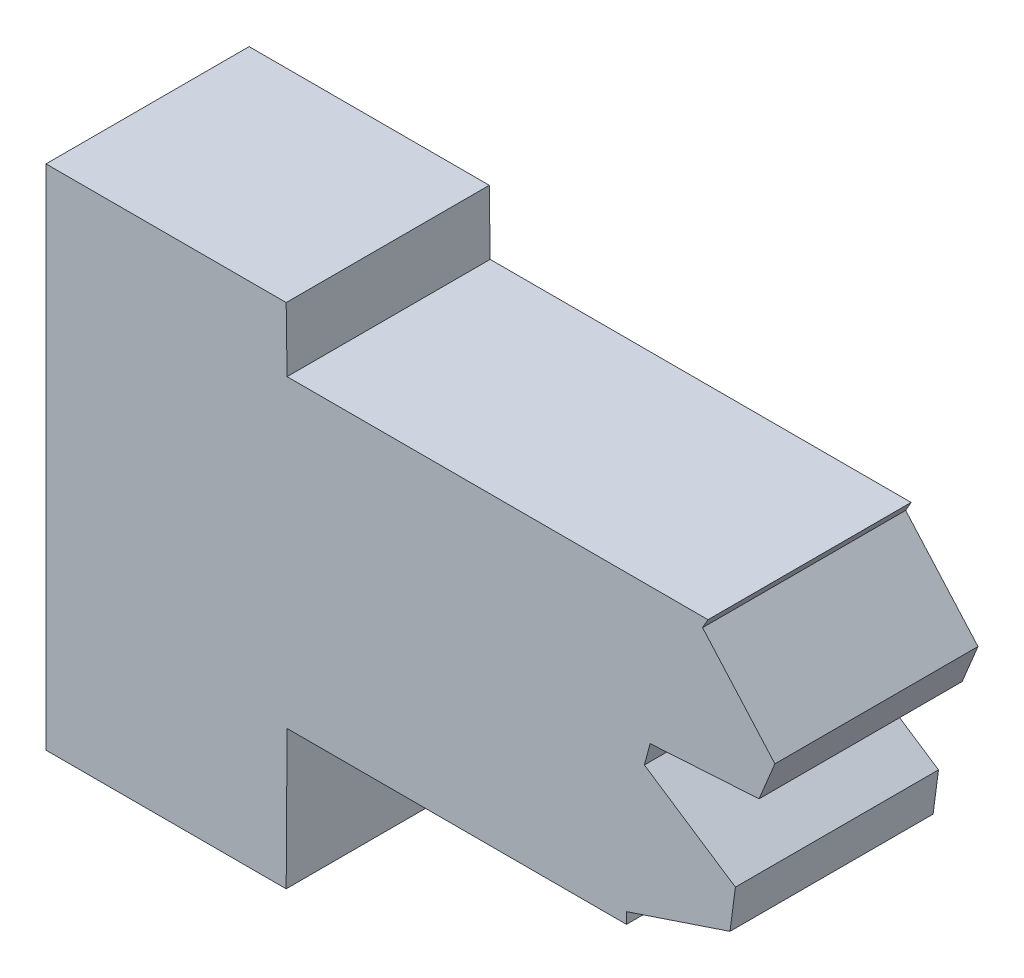
ISO-10303-21;
HEADER;
FILE_DESCRIPTION(('STEP AP214'),'2;1');
FILE_NAME('part.step','',(''),(''),'','','');
FILE_SCHEMA(('AUTOMOTIVE_DESIGN { 1 0 10303 214 1 1 1 1 }'));
ENDSEC;
DATA;
#1=APPLICATION_CONTEXT('core data for automotive mechanical design processes');
#2=APPLICATION_PROTOCOL_DEFINITION('international standard','automotive_design',2000,#1);
#3=PRODUCT_CONTEXT('',#1,'mechanical');
#4=PRODUCT('Part','Part','',(#3));
#5=PRODUCT_RELATED_PRODUCT_CATEGORY('part','',(#4));
#6=PRODUCT_DEFINITION_FORMATION('','',#4);
#7=PRODUCT_DEFINITION_CONTEXT('part definition',#1,'design');
#8=PRODUCT_DEFINITION('design','',#6,#7);
#9=PRODUCT_DEFINITION_SHAPE('','',#8);
#10=(LENGTH_UNIT() NAMED_UNIT(*) SI_UNIT(.MILLI.,.METRE.));
#11=(NAMED_UNIT(*) PLANE_ANGLE_UNIT() SI_UNIT($,.RADIAN.));
#12=(NAMED_UNIT(*) SI_UNIT($,.STERADIAN.) SOLID_ANGLE_UNIT());
#13=UNCERTAINTY_MEASURE_WITH_UNIT(LENGTH_MEASURE(1.E-05),#10,'distance_accuracy_value','');
#14=(GEOMETRIC_REPRESENTATION_CONTEXT(3) GLOBAL_UNCERTAINTY_ASSIGNED_CONTEXT((#13)) GLOBAL_UNIT_ASSIGNED_CONTEXT((#10,
#11,#12)) REPRESENTATION_CONTEXT('',''));
#15=CARTESIAN_POINT('',(0.,0.,0.));
#16=DIRECTION('',(0.,0.,1.));
#17=DIRECTION('',(1.,0.,0.));
#18=AXIS2_PLACEMENT_3D('',#15,#16,#17);
#19=CARTESIAN_POINT('',(12.9304605352733,8.55490384085248,4.));
#20=DIRECTION('',(-0.870533332407199,0.492109456491152,0.));
#21=DIRECTION('',(-0.492109456491152,-0.870533332407199,0.));
#22=AXIS2_PLACEMENT_3D('',#19,#20,#21);
#23=PLANE('',#22);
#24=DIRECTION('',(0.492109456491152,0.870533332407199,0.));
#25=VECTOR('',#24,1.);
#26=CARTESIAN_POINT('',(12.9304605352733,8.55490384085248,0.));
#27=LINE('',#26,#25);
#28=CARTESIAN_POINT('',(12.9304605352733,8.55490384085248,0.));
#29=VERTEX_POINT('',#28);
#30=CARTESIAN_POINT('',(13.0377837049311,8.74475671869166,0.));
#31=VERTEX_POINT('',#30);
#32=EDGE_CURVE('E176',#29,#31,#27,.T.);
#33=ORIENTED_EDGE('',*,*,#32,.T.);
#34=DIRECTION('',(0.,0.,-1.));
#35=VECTOR('',#34,1.);
#36=CARTESIAN_POINT('',(13.0377837049311,8.74475671869166,4.));
#37=LINE('',#36,#35);
#38=CARTESIAN_POINT('',(13.0377837049311,8.74475671869166,4.));
#39=VERTEX_POINT('',#38);
#40=EDGE_CURVE('E11',#39,#31,#37,.T.);
#41=ORIENTED_EDGE('',*,*,#40,.F.);
#42=DIRECTION('',(0.492109456491152,0.870533332407199,0.));
#43=VECTOR('',#42,1.);
#44=CARTESIAN_POINT('',(12.9304605352733,8.55490384085248,4.));
#45=LINE('',#44,#43);
#46=CARTESIAN_POINT('',(12.9304605352733,8.55490384085248,4.));
#47=VERTEX_POINT('',#46);
#48=EDGE_CURVE('E206',#47,#39,#45,.T.);
#49=ORIENTED_EDGE('',*,*,#48,.F.);
#50=DIRECTION('',(0.,0.,-1.));
#51=VECTOR('',#50,1.);
#52=CARTESIAN_POINT('',(12.9304605352733,8.55490384085248,4.));
#53=LINE('',#52,#51);
#54=EDGE_CURVE('E172',#47,#29,#53,.T.);
#55=ORIENTED_EDGE('',*,*,#54,.T.);
#56=EDGE_LOOP('',(#33,#41,#49,#55));
#57=FACE_BOUND('',#56,.T.);
#58=ADVANCED_FACE('F32',(#57),#23,.F.);
#59=CARTESIAN_POINT('',(4.74778370493112,8.74475671869166,4.));
#60=DIRECTION('',(0.,-1.,0.));
#61=DIRECTION('',(0.,0.,-1.));
#62=AXIS2_PLACEMENT_3D('',#59,#60,#61);
#63=PLANE('',#62);
#64=DIRECTION('',(-1.,0.,0.));
#65=VECTOR('',#64,1.);
#66=CARTESIAN_POINT('',(4.74778370493112,8.74475671869166,0.));
#67=LINE('',#66,#65);
#68=CARTESIAN_POINT('',(4.74778370493112,8.74475671869166,0.));
#69=VERTEX_POINT('',#68);
#70=EDGE_CURVE('E179',#31,#69,#67,.T.);
#71=ORIENTED_EDGE('',*,*,#70,.T.);
#72=DIRECTION('',(0.,0.,-1.));
#73=VECTOR('',#72,1.);
#74=CARTESIAN_POINT('',(4.74778370493112,8.74475671869166,4.));
#75=LINE('',#74,#73);
#76=CARTESIAN_POINT('',(4.74778370493112,8.74475671869166,4.));
#77=VERTEX_POINT('',#76);
#78=EDGE_CURVE('E40',#77,#69,#75,.T.);
#79=ORIENTED_EDGE('',*,*,#78,.F.);
#80=DIRECTION('',(-1.,0.,0.));
#81=VECTOR('',#80,1.);
#82=CARTESIAN_POINT('',(4.74778370493112,8.74475671869166,4.));
#83=LINE('',#82,#81);
#84=EDGE_CURVE('E115',#39,#77,#83,.T.);
#85=ORIENTED_EDGE('',*,*,#84,.F.);
#86=ORIENTED_EDGE('',*,*,#40,.T.);
#87=EDGE_LOOP('',(#71,#79,#85,#86));
#88=FACE_BOUND('',#87,.T.);
#89=ADVANCED_FACE('F304',(#88),#63,.F.);
#90=CARTESIAN_POINT('',(4.73,10.,4.));
#91=DIRECTION('',(-0.999899655561117,-0.01416611480819,0.));
#92=DIRECTION('',(0.01416611480819,-0.999899655561117,0.));
#93=AXIS2_PLACEMENT_3D('',#90,#91,#92);
#94=PLANE('',#93);
#95=DIRECTION('',(-0.01416611480819,0.999899655561117,0.));
#96=VECTOR('',#95,1.);
#97=CARTESIAN_POINT('',(4.73,10.,0.));
#98=LINE('',#97,#96);
#99=CARTESIAN_POINT('',(4.73,10.,0.));
#100=VERTEX_POINT('',#99);
#101=EDGE_CURVE('E181',#69,#100,#98,.T.);
#102=ORIENTED_EDGE('',*,*,#101,.T.);
#103=DIRECTION('',(0.,0.,-1.));
#104=VECTOR('',#103,1.);
#105=CARTESIAN_POINT('',(4.73,10.,4.));
#106=LINE('',#105,#104);
#107=CARTESIAN_POINT('',(4.73,10.,4.));
#108=VERTEX_POINT('',#107);
#109=EDGE_CURVE('E237',#108,#100,#106,.T.);
#110=ORIENTED_EDGE('',*,*,#109,.F.);
#111=DIRECTION('',(-0.01416611480819,0.999899655561117,0.));
#112=VECTOR('',#111,1.);
#113=CARTESIAN_POINT('',(4.73,10.,4.));
#114=LINE('',#113,#112);
#115=EDGE_CURVE('E245',#77,#108,#114,.T.);
#116=ORIENTED_EDGE('',*,*,#115,.F.);
#117=ORIENTED_EDGE('',*,*,#78,.T.);
#118=EDGE_LOOP('',(#102,#110,#116,#117));
#119=FACE_BOUND('',#118,.T.);
#120=ADVANCED_FACE('F243',(#119),#94,.F.);
#121=CARTESIAN_POINT('',(4.73,10.,4.));
#122=DIRECTION('',(0.,-1.,0.));
#123=DIRECTION('',(0.,0.,-1.));
#124=AXIS2_PLACEMENT_3D('',#121,#122,#123);
#125=PLANE('',#124);
#126=DIRECTION('',(-1.,0.,0.));
#127=VECTOR('',#126,1.);
#128=CARTESIAN_POINT('',(4.73,10.,0.));
#129=LINE('',#128,#127);
#130=CARTESIAN_POINT('',(0.,10.,0.));
#131=VERTEX_POINT('',#130);
#132=EDGE_CURVE('E183',#100,#131,#129,.T.);
#133=ORIENTED_EDGE('',*,*,#132,.T.);
#134=DIRECTION('',(0.,0.,-1.));
#135=VECTOR('',#134,1.);
#136=CARTESIAN_POINT('',(0.,10.,4.));
#137=LINE('',#136,#135);
#138=CARTESIAN_POINT('',(0.,10.,4.));
#139=VERTEX_POINT('',#138);
#140=EDGE_CURVE('E234',#139,#131,#137,.T.);
#141=ORIENTED_EDGE('',*,*,#140,.F.);
#142=DIRECTION('',(-1.,0.,0.));
#143=VECTOR('',#142,1.);
#144=CARTESIAN_POINT('',(4.73,10.,4.));
#145=LINE('',#144,#143);
#146=EDGE_CURVE('E263',#108,#139,#145,.T.);
#147=ORIENTED_EDGE('',*,*,#146,.F.);
#148=ORIENTED_EDGE('',*,*,#109,.T.);
#149=EDGE_LOOP('',(#133,#141,#147,#148));
#150=FACE_BOUND('',#149,.T.);
#151=ADVANCED_FACE('F254',(#150),#125,.F.);
#152=CARTESIAN_POINT('',(0.,0.,4.));
#153=DIRECTION('',(1.,0.,0.));
#154=DIRECTION('',(0.,0.,-1.));
#155=AXIS2_PLACEMENT_3D('',#152,#153,#154);
#156=PLANE('',#155);
#157=DIRECTION('',(0.,-1.,0.));
#158=VECTOR('',#157,1.);
#159=CARTESIAN_POINT('',(0.,0.,0.));
#160=LINE('',#159,#158);
#161=CARTESIAN_POINT('',(0.,0.,0.));
#162=VERTEX_POINT('',#161);
#163=EDGE_CURVE('E185',#131,#162,#160,.T.);
#164=ORIENTED_EDGE('',*,*,#163,.T.);
#165=DIRECTION('',(0.,0.,-1.));
#166=VECTOR('',#165,1.);
#167=CARTESIAN_POINT('',(0.,0.,4.));
#168=LINE('',#167,#166);
#169=CARTESIAN_POINT('',(0.,0.,4.));
#170=VERTEX_POINT('',#169);
#171=EDGE_CURVE('E231',#170,#162,#168,.T.);
#172=ORIENTED_EDGE('',*,*,#171,.F.);
#173=DIRECTION('',(0.,-1.,0.));
#174=VECTOR('',#173,1.);
#175=CARTESIAN_POINT('',(0.,0.,4.));
#176=LINE('',#175,#174);
#177=EDGE_CURVE('E260',#139,#170,#176,.T.);
#178=ORIENTED_EDGE('',*,*,#177,.F.);
#179=ORIENTED_EDGE('',*,*,#140,.T.);
#180=EDGE_LOOP('',(#164,#172,#178,#179));
#181=FACE_BOUND('',#180,.T.);
#182=ADVANCED_FACE('F258',(#181),#156,.F.);
#183=CARTESIAN_POINT('',(4.73,0.,4.));
#184=DIRECTION('',(0.,1.,0.));
#185=DIRECTION('',(0.,0.,1.));
#186=AXIS2_PLACEMENT_3D('',#183,#184,#185);
#187=PLANE('',#186);
#188=DIRECTION('',(1.,0.,0.));
#189=VECTOR('',#188,1.);
#190=CARTESIAN_POINT('',(4.73,0.,0.));
#191=LINE('',#190,#189);
#192=CARTESIAN_POINT('',(4.73,0.,0.));
#193=VERTEX_POINT('',#192);
#194=EDGE_CURVE('E187',#162,#193,#191,.T.);
#195=ORIENTED_EDGE('',*,*,#194,.T.);
#196=DIRECTION('',(0.,0.,-1.));
#197=VECTOR('',#196,1.);
#198=CARTESIAN_POINT('',(4.73,0.,4.));
#199=LINE('',#198,#197);
#200=CARTESIAN_POINT('',(4.73,0.,4.));
#201=VERTEX_POINT('',#200);
#202=EDGE_CURVE('E228',#201,#193,#199,.T.);
#203=ORIENTED_EDGE('',*,*,#202,.F.);
#204=DIRECTION('',(1.,0.,0.));
#205=VECTOR('',#204,1.);
#206=CARTESIAN_POINT('',(4.73,0.,4.));
#207=LINE('',#206,#205);
#208=EDGE_CURVE('E262',#170,#201,#207,.T.);
#209=ORIENTED_EDGE('',*,*,#208,.F.);
#210=ORIENTED_EDGE('',*,*,#171,.T.);
#211=EDGE_LOOP('',(#195,#203,#209,#210));
#212=FACE_BOUND('',#211,.T.);
#213=ADVANCED_FACE('F317',(#212),#187,.F.);
#214=CARTESIAN_POINT('',(4.74778370493112,2.74476455823996,4.));
#215=DIRECTION('',(-0.999979011054282,0.00647900076402233,0.));
#216=DIRECTION('',(-0.00647900076402233,-0.999979011054282,0.));
#217=AXIS2_PLACEMENT_3D('',#214,#215,#216);
#218=PLANE('',#217);
#219=DIRECTION('',(0.00647900076402233,0.999979011054282,0.));
#220=VECTOR('',#219,1.);
#221=CARTESIAN_POINT('',(4.74778370493112,2.74476455823996,0.));
#222=LINE('',#221,#220);
#223=CARTESIAN_POINT('',(4.74778370493112,2.74476455823996,0.));
#224=VERTEX_POINT('',#223);
#225=EDGE_CURVE('E189',#193,#224,#222,.T.);
#226=ORIENTED_EDGE('',*,*,#225,.T.);
#227=DIRECTION('',(0.,0.,-1.));
#228=VECTOR('',#227,1.);
#229=CARTESIAN_POINT('',(4.74778370493112,2.74476455823996,4.));
#230=LINE('',#229,#228);
#231=CARTESIAN_POINT('',(4.74778370493112,2.74476455823996,4.));
#232=VERTEX_POINT('',#231);
#233=EDGE_CURVE('E225',#232,#224,#230,.T.);
#234=ORIENTED_EDGE('',*,*,#233,.F.);
#235=DIRECTION('',(0.00647900076402233,0.999979011054282,0.));
#236=VECTOR('',#235,1.);
#237=CARTESIAN_POINT('',(4.74778370493112,2.74476455823996,4.));
#238=LINE('',#237,#236);
#239=EDGE_CURVE('E265',#201,#232,#238,.T.);
#240=ORIENTED_EDGE('',*,*,#239,.F.);
#241=ORIENTED_EDGE('',*,*,#202,.T.);
#242=EDGE_LOOP('',(#226,#234,#240,#241));
#243=FACE_BOUND('',#242,.T.);
#244=ADVANCED_FACE('F320',(#243),#218,.F.);
#245=CARTESIAN_POINT('',(4.74778370493112,2.74476455823996,4.));
#246=DIRECTION('',(0.,1.,0.));
#247=DIRECTION('',(0.,0.,1.));
#248=AXIS2_PLACEMENT_3D('',#245,#246,#247);
#249=PLANE('',#248);
#250=DIRECTION('',(1.,0.,0.));
#251=VECTOR('',#250,1.);
#252=CARTESIAN_POINT('',(4.74778370493112,2.74476455823996,0.));
#253=LINE('',#252,#251);
#254=CARTESIAN_POINT('',(11.4320749114308,2.74476455823996,0.));
#255=VERTEX_POINT('',#254);
#256=EDGE_CURVE('E191',#224,#255,#253,.T.);
#257=ORIENTED_EDGE('',*,*,#256,.T.);
#258=DIRECTION('',(0.,0.,-1.));
#259=VECTOR('',#258,1.);
#260=CARTESIAN_POINT('',(11.4320749114308,2.74476455823996,4.));
#261=LINE('',#260,#259);
#262=CARTESIAN_POINT('',(11.4320749114308,2.74476455823996,4.));
#263=VERTEX_POINT('',#262);
#264=EDGE_CURVE('E222',#263,#255,#261,.T.);
#265=ORIENTED_EDGE('',*,*,#264,.F.);
#266=DIRECTION('',(1.,0.,0.));
#267=VECTOR('',#266,1.);
#268=CARTESIAN_POINT('',(4.74778370493112,2.74476455823996,4.));
#269=LINE('',#268,#267);
#270=EDGE_CURVE('E271',#232,#263,#269,.T.);
#271=ORIENTED_EDGE('',*,*,#270,.F.);
#272=ORIENTED_EDGE('',*,*,#233,.T.);
#273=EDGE_LOOP('',(#257,#265,#271,#272));
#274=FACE_BOUND('',#273,.T.);
#275=ADVANCED_FACE('F324',(#274),#249,.F.);
#276=CARTESIAN_POINT('',(11.4320749114308,2.74476455823996,4.));
#277=DIRECTION('',(-1.,0.,0.));
#278=DIRECTION('',(0.,0.,1.));
#279=AXIS2_PLACEMENT_3D('',#276,#277,#278);
#280=PLANE('',#279);
#281=DIRECTION('',(0.,1.,0.));
#282=VECTOR('',#281,1.);
#283=CARTESIAN_POINT('',(11.4320749114308,2.74476455823996,0.));
#284=LINE('',#283,#282);
#285=CARTESIAN_POINT('',(11.4320749114308,2.96285256334162,0.));
#286=VERTEX_POINT('',#285);
#287=EDGE_CURVE('E193',#255,#286,#284,.T.);
#288=ORIENTED_EDGE('',*,*,#287,.T.);
#289=DIRECTION('',(0.,0.,-1.));
#290=VECTOR('',#289,1.);
#291=CARTESIAN_POINT('',(11.4320749114308,2.96285256334162,4.));
#292=LINE('',#291,#290);
#293=CARTESIAN_POINT('',(11.4320749114308,2.96285256334162,4.));
#294=VERTEX_POINT('',#293);
#295=EDGE_CURVE('E219',#294,#286,#292,.T.);
#296=ORIENTED_EDGE('',*,*,#295,.F.);
#297=DIRECTION('',(0.,1.,0.));
#298=VECTOR('',#297,1.);
#299=CARTESIAN_POINT('',(11.4320749114308,2.74476455823996,4.));
#300=LINE('',#299,#298);
#301=EDGE_CURVE('E273',#263,#294,#300,.T.);
#302=ORIENTED_EDGE('',*,*,#301,.F.);
#303=ORIENTED_EDGE('',*,*,#264,.T.);
#304=EDGE_LOOP('',(#288,#296,#302,#303));
#305=FACE_BOUND('',#304,.T.);
#306=ADVANCED_FACE('F328',(#305),#280,.F.);
#307=CARTESIAN_POINT('',(11.4320749114308,2.96285256334162,4.));
#308=DIRECTION('',(-0.31722342524605,0.948350830903397,0.));
#309=DIRECTION('',(-0.948350830903397,-0.31722342524605,0.));
#310=AXIS2_PLACEMENT_3D('',#307,#308,#309);
#311=PLANE('',#310);
#312=DIRECTION('',(0.948350830903397,0.31722342524605,0.));
#313=VECTOR('',#312,1.);
#314=CARTESIAN_POINT('',(11.4320749114308,2.96285256334162,0.));
#315=LINE('',#314,#313);
#316=CARTESIAN_POINT('',(13.4706753283553,3.64476455823994,0.));
#317=VERTEX_POINT('',#316);
#318=EDGE_CURVE('E195',#286,#317,#315,.T.);
#319=ORIENTED_EDGE('',*,*,#318,.T.);
#320=DIRECTION('',(0.,0.,-1.));
#321=VECTOR('',#320,1.);
#322=CARTESIAN_POINT('',(13.4706753283553,3.64476455823994,4.));
#323=LINE('',#322,#321);
#324=CARTESIAN_POINT('',(13.4706753283553,3.64476455823994,4.));
#325=VERTEX_POINT('',#324);
#326=EDGE_CURVE('E216',#325,#317,#323,.T.);
#327=ORIENTED_EDGE('',*,*,#326,.F.);
#328=DIRECTION('',(0.948350830903397,0.31722342524605,0.));
#329=VECTOR('',#328,1.);
#330=CARTESIAN_POINT('',(11.4320749114308,2.96285256334162,4.));
#331=LINE('',#330,#329);
#332=EDGE_CURVE('E275',#294,#325,#331,.T.);
#333=ORIENTED_EDGE('',*,*,#332,.F.);
#334=ORIENTED_EDGE('',*,*,#295,.T.);
#335=EDGE_LOOP('',(#319,#327,#333,#334));
#336=FACE_BOUND('',#335,.T.);
#337=ADVANCED_FACE('F332',(#336),#311,.F.);
#338=CARTESIAN_POINT('',(13.4706753283553,3.64476455823994,4.));
#339=DIRECTION('',(-0.991444861373811,0.130526192220048,0.));
#340=DIRECTION('',(-0.130526192220048,-0.991444861373811,0.));
#341=AXIS2_PLACEMENT_3D('',#338,#339,#340);
#342=PLANE('',#341);
#343=DIRECTION('',(0.130526192220048,0.991444861373811,0.));
#344=VECTOR('',#343,1.);
#345=CARTESIAN_POINT('',(13.4706753283553,3.64476455823994,0.));
#346=LINE('',#345,#344);
#347=CARTESIAN_POINT('',(13.5770971149535,4.45311828147681,0.));
#348=VERTEX_POINT('',#347);
#349=EDGE_CURVE('E197',#317,#348,#346,.T.);
#350=ORIENTED_EDGE('',*,*,#349,.T.);
#351=DIRECTION('',(0.,0.,-1.));
#352=VECTOR('',#351,1.);
#353=CARTESIAN_POINT('',(13.5770971149535,4.45311828147681,4.));
#354=LINE('',#353,#352);
#355=CARTESIAN_POINT('',(13.5770971149535,4.45311828147681,4.));
#356=VERTEX_POINT('',#355);
#357=EDGE_CURVE('E213',#356,#348,#354,.T.);
#358=ORIENTED_EDGE('',*,*,#357,.F.);
#359=DIRECTION('',(0.130526192220048,0.991444861373811,0.));
#360=VECTOR('',#359,1.);
#361=CARTESIAN_POINT('',(13.4706753283553,3.64476455823994,4.));
#362=LINE('',#361,#360);
#363=EDGE_CURVE('E277',#325,#356,#362,.T.);
#364=ORIENTED_EDGE('',*,*,#363,.F.);
#365=ORIENTED_EDGE('',*,*,#326,.T.);
#366=EDGE_LOOP('',(#350,#358,#364,#365));
#367=FACE_BOUND('',#366,.T.);
#368=ADVANCED_FACE('F336',(#367),#342,.F.);
#369=CARTESIAN_POINT('',(13.5770971149535,4.45311828147681,4.));
#370=DIRECTION('',(-0.551865555625634,-0.833933095945958,0.));
#371=DIRECTION('',(0.833933095945958,-0.551865555625634,0.));
#372=AXIS2_PLACEMENT_3D('',#369,#370,#371);
#373=PLANE('',#372);
#374=DIRECTION('',(-0.833933095945958,0.551865555625634,0.));
#375=VECTOR('',#374,1.);
#376=CARTESIAN_POINT('',(13.5770971149535,4.45311828147681,0.));
#377=LINE('',#376,#375);
#378=CARTESIAN_POINT('',(11.784452134126,5.63942330185938,0.));
#379=VERTEX_POINT('',#378);
#380=EDGE_CURVE('E199',#348,#379,#377,.T.);
#381=ORIENTED_EDGE('',*,*,#380,.T.);
#382=DIRECTION('',(0.,0.,-1.));
#383=VECTOR('',#382,1.);
#384=CARTESIAN_POINT('',(11.784452134126,5.63942330185938,4.));
#385=LINE('',#384,#383);
#386=CARTESIAN_POINT('',(11.784452134126,5.63942330185938,4.));
#387=VERTEX_POINT('',#386);
#388=EDGE_CURVE('E210',#387,#379,#385,.T.);
#389=ORIENTED_EDGE('',*,*,#388,.F.);
#390=DIRECTION('',(-0.833933095945958,0.551865555625634,0.));
#391=VECTOR('',#390,1.);
#392=CARTESIAN_POINT('',(13.5770971149535,4.45311828147681,4.));
#393=LINE('',#392,#391);
#394=EDGE_CURVE('E279',#356,#387,#393,.T.);
#395=ORIENTED_EDGE('',*,*,#394,.F.);
#396=ORIENTED_EDGE('',*,*,#357,.T.);
#397=EDGE_LOOP('',(#381,#389,#395,#396));
#398=FACE_BOUND('',#397,.T.);
#399=ADVANCED_FACE('F285',(#398),#373,.F.);
#400=CARTESIAN_POINT('',(11.784452134126,5.63942330185938,4.));
#401=DIRECTION('',(-0.965925826289063,0.258819045102539,0.));
#402=DIRECTION('',(-0.258819045102539,-0.965925826289063,0.));
#403=AXIS2_PLACEMENT_3D('',#400,#401,#402);
#404=PLANE('',#403);
#405=DIRECTION('',(0.258819045102539,0.965925826289064,0.));
#406=VECTOR('',#405,1.);
#407=CARTESIAN_POINT('',(11.784452134126,5.63942330185938,0.));
#408=LINE('',#407,#406);
#409=CARTESIAN_POINT('',(11.8973427925835,6.06073697492256,0.));
#410=VERTEX_POINT('',#409);
#411=EDGE_CURVE('E201',#379,#410,#408,.T.);
#412=ORIENTED_EDGE('',*,*,#411,.T.);
#413=DIRECTION('',(0.,0.,-1.));
#414=VECTOR('',#413,1.);
#415=CARTESIAN_POINT('',(11.8973427925835,6.06073697492256,4.));
#416=LINE('',#415,#414);
#417=CARTESIAN_POINT('',(11.8973427925835,6.06073697492256,4.));
#418=VERTEX_POINT('',#417);
#419=EDGE_CURVE('E167',#418,#410,#416,.T.);
#420=ORIENTED_EDGE('',*,*,#419,.F.);
#421=DIRECTION('',(0.258819045102539,0.965925826289064,0.));
#422=VECTOR('',#421,1.);
#423=CARTESIAN_POINT('',(11.784452134126,5.63942330185938,4.));
#424=LINE('',#423,#422);
#425=EDGE_CURVE('E158',#387,#418,#424,.T.);
#426=ORIENTED_EDGE('',*,*,#425,.F.);
#427=ORIENTED_EDGE('',*,*,#388,.T.);
#428=EDGE_LOOP('',(#412,#420,#426,#427));
#429=FACE_BOUND('',#428,.T.);
#430=ADVANCED_FACE('F289',(#429),#404,.F.);
#431=CARTESIAN_POINT('',(11.8973427925835,6.06073697492256,4.));
#432=DIRECTION('',(-0.060963042672375,0.998140023958626,0.));
#433=DIRECTION('',(-0.998140023958626,-0.060963042672375,0.));
#434=AXIS2_PLACEMENT_3D('',#431,#432,#433);
#435=PLANE('',#434);
#436=DIRECTION('',(0.998140023958626,0.060963042672375,0.));
#437=VECTOR('',#436,1.);
#438=CARTESIAN_POINT('',(11.8973427925835,6.06073697492256,0.));
#439=LINE('',#438,#437);
#440=CARTESIAN_POINT('',(14.0429713961381,6.19178476879701,0.));
#441=VERTEX_POINT('',#440);
#442=EDGE_CURVE('E166',#410,#441,#439,.T.);
#443=ORIENTED_EDGE('',*,*,#442,.T.);
#444=DIRECTION('',(0.,0.,-1.));
#445=VECTOR('',#444,1.);
#446=CARTESIAN_POINT('',(14.0429713961381,6.19178476879701,4.));
#447=LINE('',#446,#445);
#448=CARTESIAN_POINT('',(14.0429713961381,6.19178476879701,4.));
#449=VERTEX_POINT('',#448);
#450=EDGE_CURVE('E163',#449,#441,#447,.T.);
#451=ORIENTED_EDGE('',*,*,#450,.F.);
#452=DIRECTION('',(0.998140023958626,0.060963042672375,0.));
#453=VECTOR('',#452,1.);
#454=CARTESIAN_POINT('',(11.8973427925835,6.06073697492256,4.));
#455=LINE('',#454,#453);
#456=EDGE_CURVE('E152',#418,#449,#455,.T.);
#457=ORIENTED_EDGE('',*,*,#456,.F.);
#458=ORIENTED_EDGE('',*,*,#419,.T.);
#459=EDGE_LOOP('',(#443,#451,#457,#458));
#460=FACE_BOUND('',#459,.T.);
#461=ADVANCED_FACE('F164',(#460),#435,.F.);
#462=CARTESIAN_POINT('',(14.0429713961381,6.19178476879701,4.));
#463=DIRECTION('',(-0.923879532511289,0.382683432365085,0.));
#464=DIRECTION('',(-0.382683432365085,-0.923879532511289,0.));
#465=AXIS2_PLACEMENT_3D('',#462,#463,#464);
#466=PLANE('',#465);
#467=DIRECTION('',(0.382683432365085,0.923879532511289,0.));
#468=VECTOR('',#467,1.);
#469=CARTESIAN_POINT('',(14.0429713961381,6.19178476879701,0.));
#470=LINE('',#469,#468);
#471=CARTESIAN_POINT('',(14.3549842870463,6.94505052166298,0.));
#472=VERTEX_POINT('',#471);
#473=EDGE_CURVE('E101',#441,#472,#470,.T.);
#474=ORIENTED_EDGE('',*,*,#473,.T.);
#475=DIRECTION('',(0.,0.,-1.));
#476=VECTOR('',#475,1.);
#477=CARTESIAN_POINT('',(14.3549842870463,6.94505052166298,4.));
#478=LINE('',#477,#476);
#479=CARTESIAN_POINT('',(14.3549842870463,6.94505052166298,4.));
#480=VERTEX_POINT('',#479);
#481=EDGE_CURVE('E168',#480,#472,#478,.T.);
#482=ORIENTED_EDGE('',*,*,#481,.F.);
#483=DIRECTION('',(0.382683432365085,0.923879532511289,0.));
#484=VECTOR('',#483,1.);
#485=CARTESIAN_POINT('',(14.0429713961381,6.19178476879701,4.));
#486=LINE('',#485,#484);
#487=EDGE_CURVE('E156',#449,#480,#486,.T.);
#488=ORIENTED_EDGE('',*,*,#487,.F.);
#489=ORIENTED_EDGE('',*,*,#450,.T.);
#490=EDGE_LOOP('',(#474,#482,#488,#489));
#491=FACE_BOUND('',#490,.T.);
#492=ADVANCED_FACE('F170',(#491),#466,.F.);
#493=CARTESIAN_POINT('',(14.3549842870463,6.94505052166298,4.));
#494=DIRECTION('',(-0.748898960390284,-0.662684198639407,0.));
#495=DIRECTION('',(0.662684198639407,-0.748898960390284,0.));
#496=AXIS2_PLACEMENT_3D('',#493,#494,#495);
#497=PLANE('',#496);
#498=DIRECTION('',(-0.662684198639407,0.748898960390284,0.));
#499=VECTOR('',#498,1.);
#500=CARTESIAN_POINT('',(14.3549842870463,6.94505052166298,0.));
#501=LINE('',#500,#499);
#502=EDGE_CURVE('E107',#472,#29,#501,.T.);
#503=ORIENTED_EDGE('',*,*,#502,.T.);
#504=ORIENTED_EDGE('',*,*,#54,.F.);
#505=DIRECTION('',(-0.662684198639407,0.748898960390284,0.));
#506=VECTOR('',#505,1.);
#507=CARTESIAN_POINT('',(14.3549842870463,6.94505052166298,4.));
#508=LINE('',#507,#506);
#509=EDGE_CURVE('E48',#480,#47,#508,.T.);
#510=ORIENTED_EDGE('',*,*,#509,.F.);
#511=ORIENTED_EDGE('',*,*,#481,.T.);
#512=EDGE_LOOP('',(#503,#504,#510,#511));
#513=FACE_BOUND('',#512,.T.);
#514=ADVANCED_FACE('F293',(#513),#497,.F.);
#515=CARTESIAN_POINT('',(0.,0.,4.));
#516=DIRECTION('',(0.,0.,1.));
#517=DIRECTION('',(1.,0.,0.));
#518=AXIS2_PLACEMENT_3D('',#515,#516,#517);
#519=PLANE('',#518);
#520=ORIENTED_EDGE('',*,*,#48,.T.);
#521=ORIENTED_EDGE('',*,*,#84,.T.);
#522=ORIENTED_EDGE('',*,*,#115,.T.);
#523=ORIENTED_EDGE('',*,*,#146,.T.);
#524=ORIENTED_EDGE('',*,*,#177,.T.);
#525=ORIENTED_EDGE('',*,*,#208,.T.);
#526=ORIENTED_EDGE('',*,*,#239,.T.);
#527=ORIENTED_EDGE('',*,*,#270,.T.);
#528=ORIENTED_EDGE('',*,*,#301,.T.);
#529=ORIENTED_EDGE('',*,*,#332,.T.);
#530=ORIENTED_EDGE('',*,*,#363,.T.);
#531=ORIENTED_EDGE('',*,*,#394,.T.);
#532=ORIENTED_EDGE('',*,*,#425,.T.);
#533=ORIENTED_EDGE('',*,*,#456,.T.);
#534=ORIENTED_EDGE('',*,*,#487,.T.);
#535=ORIENTED_EDGE('',*,*,#509,.T.);
#536=EDGE_LOOP('',(#520,#521,#522,#523,#524,#525,#526,#527,#528,#529,#530,#531,#532,#533,#534,#535));
#537=FACE_BOUND('',#536,.T.);
#538=ADVANCED_FACE('F154',(#537),#519,.T.);
#539=CARTESIAN_POINT('',(0.,0.,0.));
#540=DIRECTION('',(0.,0.,1.));
#541=DIRECTION('',(1.,0.,0.));
#542=AXIS2_PLACEMENT_3D('',#539,#540,#541);
#543=PLANE('',#542);
#544=ORIENTED_EDGE('',*,*,#32,.F.);
#545=ORIENTED_EDGE('',*,*,#502,.F.);
#546=ORIENTED_EDGE('',*,*,#473,.F.);
#547=ORIENTED_EDGE('',*,*,#442,.F.);
#548=ORIENTED_EDGE('',*,*,#411,.F.);
#549=ORIENTED_EDGE('',*,*,#380,.F.);
#550=ORIENTED_EDGE('',*,*,#349,.F.);
#551=ORIENTED_EDGE('',*,*,#318,.F.);
#552=ORIENTED_EDGE('',*,*,#287,.F.);
#553=ORIENTED_EDGE('',*,*,#256,.F.);
#554=ORIENTED_EDGE('',*,*,#225,.F.);
#555=ORIENTED_EDGE('',*,*,#194,.F.);
#556=ORIENTED_EDGE('',*,*,#163,.F.);
#557=ORIENTED_EDGE('',*,*,#132,.F.);
#558=ORIENTED_EDGE('',*,*,#101,.F.);
#559=ORIENTED_EDGE('',*,*,#70,.F.);
#560=EDGE_LOOP('',(#544,#545,#546,#547,#548,#549,#550,#551,#552,#553,#554,#555,#556,#557,#558,#559));
#561=FACE_BOUND('',#560,.T.);
#562=ADVANCED_FACE('F249',(#561),#543,.F.);
#563=CLOSED_SHELL('',(#58,#89,#120,#151,#182,#213,#244,#275,#306,#337,#368,#399,#430,#461,#492,
#514,#538,#562));
#564=MANIFOLD_SOLID_BREP('B2',#563);
#565=ADVANCED_BREP_SHAPE_REPRESENTATION('',(#18,#564),#14);
#566=SHAPE_DEFINITION_REPRESENTATION(#9,#565);
ENDSEC;
END-ISO-10303-21;
